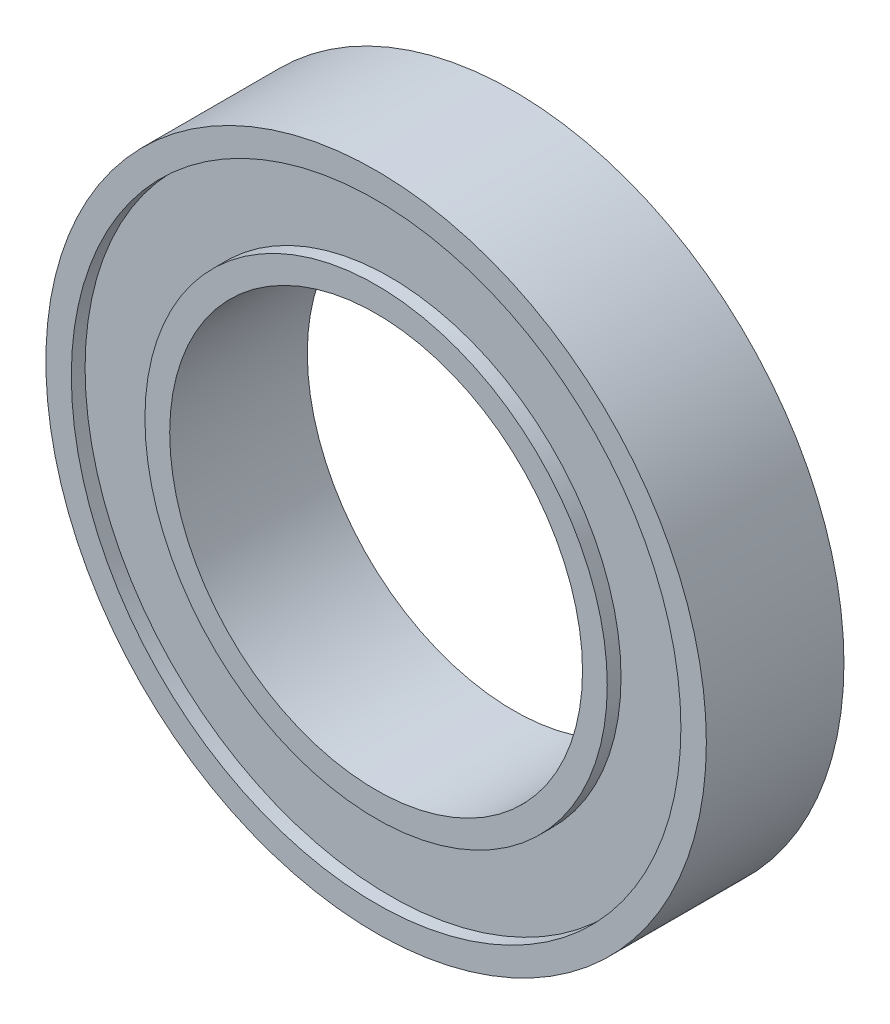
ISO-10303-21;
HEADER;
FILE_DESCRIPTION(('STEP AP214'),'2;1');
FILE_NAME('part.step','',(''),(''),'','','');
FILE_SCHEMA(('AUTOMOTIVE_DESIGN { 1 0 10303 214 1 1 1 1 }'));
ENDSEC;
DATA;
#1=APPLICATION_CONTEXT('core data for automotive mechanical design processes');
#2=APPLICATION_PROTOCOL_DEFINITION('international standard','automotive_design',2000,#1);
#3=PRODUCT_CONTEXT('',#1,'mechanical');
#4=PRODUCT('Part','Part','',(#3));
#5=PRODUCT_RELATED_PRODUCT_CATEGORY('part','',(#4));
#6=PRODUCT_DEFINITION_FORMATION('','',#4);
#7=PRODUCT_DEFINITION_CONTEXT('part definition',#1,'design');
#8=PRODUCT_DEFINITION('design','',#6,#7);
#9=PRODUCT_DEFINITION_SHAPE('','',#8);
#10=(LENGTH_UNIT() NAMED_UNIT(*) SI_UNIT(.MILLI.,.METRE.));
#11=(NAMED_UNIT(*) PLANE_ANGLE_UNIT() SI_UNIT($,.RADIAN.));
#12=(NAMED_UNIT(*) SI_UNIT($,.STERADIAN.) SOLID_ANGLE_UNIT());
#13=UNCERTAINTY_MEASURE_WITH_UNIT(LENGTH_MEASURE(1.E-05),#10,'distance_accuracy_value','');
#14=(GEOMETRIC_REPRESENTATION_CONTEXT(3) GLOBAL_UNCERTAINTY_ASSIGNED_CONTEXT((#13)) GLOBAL_UNIT_ASSIGNED_CONTEXT((#10,
#11,#12)) REPRESENTATION_CONTEXT('',''));
#15=CARTESIAN_POINT('',(0.,0.,0.));
#16=DIRECTION('',(0.,0.,1.));
#17=DIRECTION('',(1.,0.,0.));
#18=AXIS2_PLACEMENT_3D('',#15,#16,#17);
#19=CARTESIAN_POINT('',(0.,0.,0.));
#20=DIRECTION('',(0.,0.,1.));
#21=DIRECTION('',(1.,0.,0.));
#22=AXIS2_PLACEMENT_3D('',#19,#20,#21);
#23=PLANE('',#22);
#24=CARTESIAN_POINT('',(0.,0.,0.));
#25=DIRECTION('',(0.,0.,1.));
#26=DIRECTION('',(1.,0.,0.));
#27=AXIS2_PLACEMENT_3D('',#24,#25,#26);
#28=CIRCLE('',#27,7.5);
#29=CARTESIAN_POINT('',(7.5,0.,0.));
#30=VERTEX_POINT('',#29);
#31=EDGE_CURVE('E41',#30,#30,#28,.T.);
#32=ORIENTED_EDGE('',*,*,#31,.T.);
#33=EDGE_LOOP('',(#32));
#34=FACE_BOUND('',#33,.T.);
#35=CARTESIAN_POINT('',(0.,0.,0.));
#36=DIRECTION('',(0.,0.,-1.));
#37=DIRECTION('',(-1.,0.,0.));
#38=AXIS2_PLACEMENT_3D('',#35,#36,#37);
#39=CIRCLE('',#38,8.4);
#40=CARTESIAN_POINT('',(-8.4,0.,0.));
#41=VERTEX_POINT('',#40);
#42=EDGE_CURVE('E67',#41,#41,#39,.T.);
#43=ORIENTED_EDGE('',*,*,#42,.T.);
#44=EDGE_LOOP('',(#43));
#45=FACE_BOUND('',#44,.T.);
#46=ADVANCED_FACE('F30',(#34,#45),#23,.F.);
#47=CARTESIAN_POINT('',(0.,0.,5.));
#48=DIRECTION('',(0.,0.,1.));
#49=DIRECTION('',(1.,0.,0.));
#50=AXIS2_PLACEMENT_3D('',#47,#48,#49);
#51=PLANE('',#50);
#52=CARTESIAN_POINT('',(0.,0.,5.));
#53=DIRECTION('',(0.,0.,1.));
#54=DIRECTION('',(1.,0.,0.));
#55=AXIS2_PLACEMENT_3D('',#52,#53,#54);
#56=CIRCLE('',#55,7.5);
#57=CARTESIAN_POINT('',(7.5,0.,5.));
#58=VERTEX_POINT('',#57);
#59=EDGE_CURVE('E43',#58,#58,#56,.T.);
#60=ORIENTED_EDGE('',*,*,#59,.F.);
#61=EDGE_LOOP('',(#60));
#62=FACE_BOUND('',#61,.T.);
#63=CARTESIAN_POINT('',(0.,0.,5.));
#64=DIRECTION('',(0.,0.,1.));
#65=DIRECTION('',(1.,0.,0.));
#66=AXIS2_PLACEMENT_3D('',#63,#64,#65);
#67=CIRCLE('',#66,8.4);
#68=CARTESIAN_POINT('',(8.4,0.,5.));
#69=VERTEX_POINT('',#68);
#70=EDGE_CURVE('E55',#69,#69,#67,.T.);
#71=ORIENTED_EDGE('',*,*,#70,.T.);
#72=EDGE_LOOP('',(#71));
#73=FACE_BOUND('',#72,.T.);
#74=ADVANCED_FACE('F97',(#62,#73),#51,.T.);
#75=CARTESIAN_POINT('',(0.,0.,5.));
#76=DIRECTION('',(0.,0.,-1.));
#77=DIRECTION('',(-1.,0.,0.));
#78=AXIS2_PLACEMENT_3D('',#75,#76,#77);
#79=CYLINDRICAL_SURFACE('',#78,12.);
#80=CARTESIAN_POINT('',(0.,0.,5.));
#81=DIRECTION('',(0.,0.,1.));
#82=DIRECTION('',(1.,0.,0.));
#83=AXIS2_PLACEMENT_3D('',#80,#81,#82);
#84=CIRCLE('',#83,12.);
#85=CARTESIAN_POINT('',(12.,0.,5.));
#86=VERTEX_POINT('',#85);
#87=EDGE_CURVE('E10',#86,#86,#84,.T.);
#88=ORIENTED_EDGE('',*,*,#87,.F.);
#89=EDGE_LOOP('',(#88));
#90=FACE_BOUND('',#89,.T.);
#91=CARTESIAN_POINT('',(0.,0.,0.));
#92=DIRECTION('',(0.,0.,1.));
#93=DIRECTION('',(1.,0.,0.));
#94=AXIS2_PLACEMENT_3D('',#91,#92,#93);
#95=CIRCLE('',#94,12.);
#96=CARTESIAN_POINT('',(12.,0.,0.));
#97=VERTEX_POINT('',#96);
#98=EDGE_CURVE('E34',#97,#97,#95,.T.);
#99=ORIENTED_EDGE('',*,*,#98,.T.);
#100=EDGE_LOOP('',(#99));
#101=FACE_BOUND('',#100,.T.);
#102=ADVANCED_FACE('F32',(#90,#101),#79,.T.);
#103=CARTESIAN_POINT('',(0.,0.,5.));
#104=DIRECTION('',(0.,0.,1.));
#105=DIRECTION('',(1.,0.,0.));
#106=AXIS2_PLACEMENT_3D('',#103,#104,#105);
#107=CIRCLE('',#106,11.075);
#108=CARTESIAN_POINT('',(11.075,0.,5.));
#109=VERTEX_POINT('',#108);
#110=EDGE_CURVE('E49',#109,#109,#107,.T.);
#111=ORIENTED_EDGE('',*,*,#110,.F.);
#112=EDGE_LOOP('',(#111));
#113=FACE_BOUND('',#112,.T.);
#114=ORIENTED_EDGE('',*,*,#87,.T.);
#115=EDGE_LOOP('',(#114));
#116=FACE_BOUND('',#115,.T.);
#117=ADVANCED_FACE('F93',(#113,#116),#51,.T.);
#118=CARTESIAN_POINT('',(0.,0.,0.));
#119=DIRECTION('',(0.,0.,-1.));
#120=DIRECTION('',(-1.,0.,0.));
#121=AXIS2_PLACEMENT_3D('',#118,#119,#120);
#122=CIRCLE('',#121,11.075);
#123=CARTESIAN_POINT('',(-11.075,0.,0.));
#124=VERTEX_POINT('',#123);
#125=EDGE_CURVE('E61',#124,#124,#122,.T.);
#126=ORIENTED_EDGE('',*,*,#125,.F.);
#127=EDGE_LOOP('',(#126));
#128=FACE_BOUND('',#127,.T.);
#129=ORIENTED_EDGE('',*,*,#98,.F.);
#130=EDGE_LOOP('',(#129));
#131=FACE_BOUND('',#130,.T.);
#132=ADVANCED_FACE('F89',(#128,#131),#23,.F.);
#133=CARTESIAN_POINT('',(0.,0.,0.));
#134=DIRECTION('',(0.,0.,1.));
#135=DIRECTION('',(1.,0.,0.));
#136=AXIS2_PLACEMENT_3D('',#133,#134,#135);
#137=CYLINDRICAL_SURFACE('',#136,7.5);
#138=ORIENTED_EDGE('',*,*,#31,.F.);
#139=EDGE_LOOP('',(#138));
#140=FACE_BOUND('',#139,.T.);
#141=ORIENTED_EDGE('',*,*,#59,.T.);
#142=EDGE_LOOP('',(#141));
#143=FACE_BOUND('',#142,.T.);
#144=ADVANCED_FACE('F92',(#140,#143),#137,.F.);
#145=CARTESIAN_POINT('',(0.,0.,4.5));
#146=DIRECTION('',(0.,0.,1.));
#147=DIRECTION('',(1.,0.,0.));
#148=AXIS2_PLACEMENT_3D('',#145,#146,#147);
#149=CYLINDRICAL_SURFACE('',#148,11.075);
#150=CARTESIAN_POINT('',(0.,0.,4.5));
#151=DIRECTION('',(0.,0.,1.));
#152=DIRECTION('',(1.,0.,0.));
#153=AXIS2_PLACEMENT_3D('',#150,#151,#152);
#154=CIRCLE('',#153,11.075);
#155=CARTESIAN_POINT('',(11.075,0.,4.5));
#156=VERTEX_POINT('',#155);
#157=EDGE_CURVE('E46',#156,#156,#154,.T.);
#158=ORIENTED_EDGE('',*,*,#157,.F.);
#159=EDGE_LOOP('',(#158));
#160=FACE_BOUND('',#159,.T.);
#161=ORIENTED_EDGE('',*,*,#110,.T.);
#162=EDGE_LOOP('',(#161));
#163=FACE_BOUND('',#162,.T.);
#164=ADVANCED_FACE('F114',(#160,#163),#149,.F.);
#165=CARTESIAN_POINT('',(0.,0.,4.5));
#166=DIRECTION('',(0.,0.,1.));
#167=DIRECTION('',(1.,0.,0.));
#168=AXIS2_PLACEMENT_3D('',#165,#166,#167);
#169=PLANE('',#168);
#170=CARTESIAN_POINT('',(0.,0.,4.5));
#171=DIRECTION('',(0.,0.,1.));
#172=DIRECTION('',(1.,0.,0.));
#173=AXIS2_PLACEMENT_3D('',#170,#171,#172);
#174=CIRCLE('',#173,8.4);
#175=CARTESIAN_POINT('',(8.4,0.,4.5));
#176=VERTEX_POINT('',#175);
#177=EDGE_CURVE('E52',#176,#176,#174,.T.);
#178=ORIENTED_EDGE('',*,*,#177,.F.);
#179=EDGE_LOOP('',(#178));
#180=FACE_BOUND('',#179,.T.);
#181=ORIENTED_EDGE('',*,*,#157,.T.);
#182=EDGE_LOOP('',(#181));
#183=FACE_BOUND('',#182,.T.);
#184=ADVANCED_FACE('F118',(#180,#183),#169,.T.);
#185=CARTESIAN_POINT('',(0.,0.,4.5));
#186=DIRECTION('',(0.,0.,1.));
#187=DIRECTION('',(1.,0.,0.));
#188=AXIS2_PLACEMENT_3D('',#185,#186,#187);
#189=CYLINDRICAL_SURFACE('',#188,8.4);
#190=ORIENTED_EDGE('',*,*,#177,.T.);
#191=EDGE_LOOP('',(#190));
#192=FACE_BOUND('',#191,.T.);
#193=ORIENTED_EDGE('',*,*,#70,.F.);
#194=EDGE_LOOP('',(#193));
#195=FACE_BOUND('',#194,.T.);
#196=ADVANCED_FACE('F85',(#192,#195),#189,.T.);
#197=CARTESIAN_POINT('',(0.,0.,0.5));
#198=DIRECTION('',(0.,0.,-1.));
#199=DIRECTION('',(-1.,0.,0.));
#200=AXIS2_PLACEMENT_3D('',#197,#198,#199);
#201=CYLINDRICAL_SURFACE('',#200,11.075);
#202=CARTESIAN_POINT('',(0.,0.,0.5));
#203=DIRECTION('',(0.,0.,-1.));
#204=DIRECTION('',(-1.,0.,0.));
#205=AXIS2_PLACEMENT_3D('',#202,#203,#204);
#206=CIRCLE('',#205,11.075);
#207=CARTESIAN_POINT('',(-11.075,0.,0.5));
#208=VERTEX_POINT('',#207);
#209=EDGE_CURVE('E58',#208,#208,#206,.T.);
#210=ORIENTED_EDGE('',*,*,#209,.F.);
#211=EDGE_LOOP('',(#210));
#212=FACE_BOUND('',#211,.T.);
#213=ORIENTED_EDGE('',*,*,#125,.T.);
#214=EDGE_LOOP('',(#213));
#215=FACE_BOUND('',#214,.T.);
#216=ADVANCED_FACE('F79',(#212,#215),#201,.F.);
#217=CARTESIAN_POINT('',(0.,0.,0.5));
#218=DIRECTION('',(0.,0.,-1.));
#219=DIRECTION('',(-1.,0.,0.));
#220=AXIS2_PLACEMENT_3D('',#217,#218,#219);
#221=PLANE('',#220);
#222=CARTESIAN_POINT('',(0.,0.,0.5));
#223=DIRECTION('',(0.,0.,-1.));
#224=DIRECTION('',(-1.,0.,0.));
#225=AXIS2_PLACEMENT_3D('',#222,#223,#224);
#226=CIRCLE('',#225,8.4);
#227=CARTESIAN_POINT('',(-8.4,0.,0.5));
#228=VERTEX_POINT('',#227);
#229=EDGE_CURVE('E64',#228,#228,#226,.T.);
#230=ORIENTED_EDGE('',*,*,#229,.F.);
#231=EDGE_LOOP('',(#230));
#232=FACE_BOUND('',#231,.T.);
#233=ORIENTED_EDGE('',*,*,#209,.T.);
#234=EDGE_LOOP('',(#233));
#235=FACE_BOUND('',#234,.T.);
#236=ADVANCED_FACE('F76',(#232,#235),#221,.T.);
#237=CARTESIAN_POINT('',(0.,0.,0.5));
#238=DIRECTION('',(0.,0.,-1.));
#239=DIRECTION('',(-1.,0.,0.));
#240=AXIS2_PLACEMENT_3D('',#237,#238,#239);
#241=CYLINDRICAL_SURFACE('',#240,8.4);
#242=ORIENTED_EDGE('',*,*,#229,.T.);
#243=EDGE_LOOP('',(#242));
#244=FACE_BOUND('',#243,.T.);
#245=ORIENTED_EDGE('',*,*,#42,.F.);
#246=EDGE_LOOP('',(#245));
#247=FACE_BOUND('',#246,.T.);
#248=ADVANCED_FACE('F73',(#244,#247),#241,.T.);
#249=CLOSED_SHELL('',(#46,#74,#102,#117,#132,#144,#164,#184,#196,#216,#236,#248));
#250=MANIFOLD_SOLID_BREP('B2',#249);
#251=ADVANCED_BREP_SHAPE_REPRESENTATION('',(#18,#250),#14);
#252=SHAPE_DEFINITION_REPRESENTATION(#9,#251);
ENDSEC;
END-ISO-10303-21;
